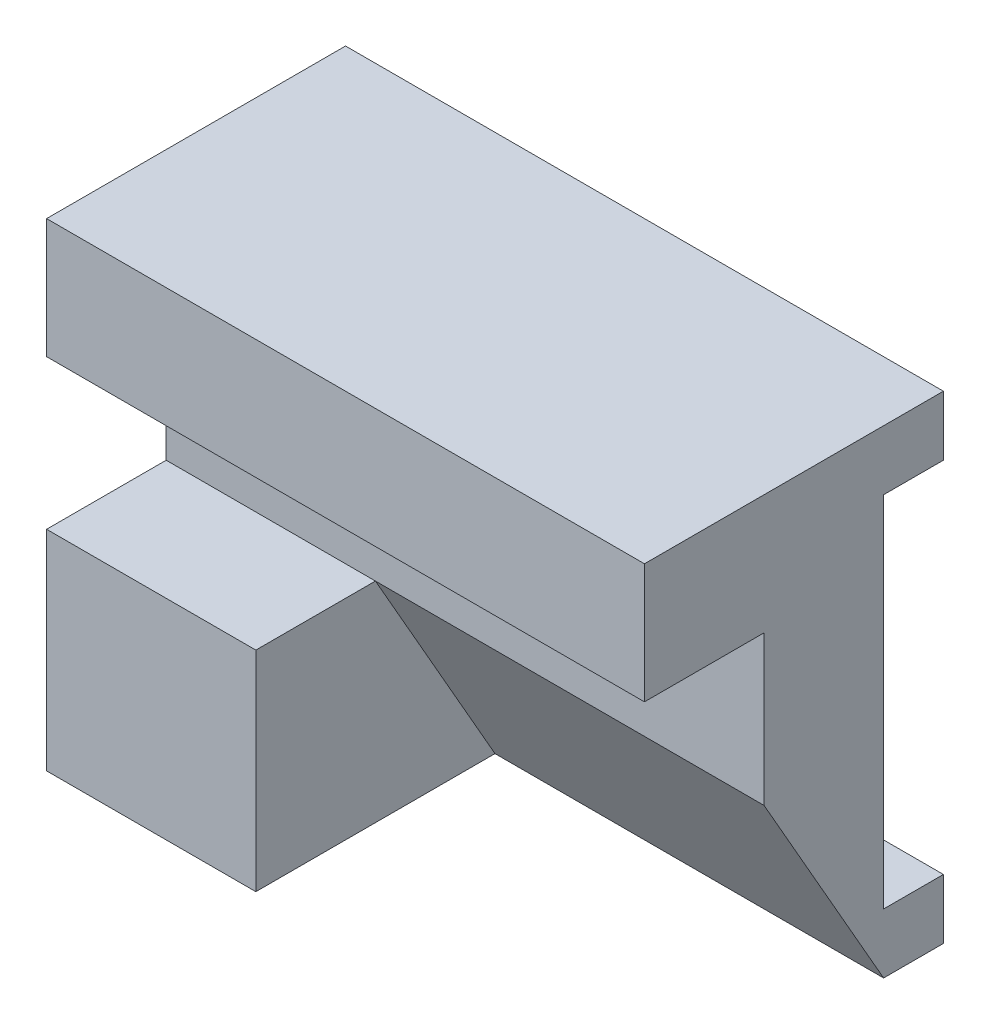
ISO-10303-21;
HEADER;
FILE_DESCRIPTION(('STEP AP214'),'2;1');
FILE_NAME('part.step','',(''),(''),'','','');
FILE_SCHEMA(('AUTOMOTIVE_DESIGN { 1 0 10303 214 1 1 1 1 }'));
ENDSEC;
DATA;
#1=APPLICATION_CONTEXT('core data for automotive mechanical design processes');
#2=APPLICATION_PROTOCOL_DEFINITION('international standard','automotive_design',2000,#1);
#3=PRODUCT_CONTEXT('',#1,'mechanical');
#4=PRODUCT('Part','Part','',(#3));
#5=PRODUCT_RELATED_PRODUCT_CATEGORY('part','',(#4));
#6=PRODUCT_DEFINITION_FORMATION('','',#4);
#7=PRODUCT_DEFINITION_CONTEXT('part definition',#1,'design');
#8=PRODUCT_DEFINITION('design','',#6,#7);
#9=PRODUCT_DEFINITION_SHAPE('','',#8);
#10=(LENGTH_UNIT() NAMED_UNIT(*) SI_UNIT(.MILLI.,.METRE.));
#11=(NAMED_UNIT(*) PLANE_ANGLE_UNIT() SI_UNIT($,.RADIAN.));
#12=(NAMED_UNIT(*) SI_UNIT($,.STERADIAN.) SOLID_ANGLE_UNIT());
#13=UNCERTAINTY_MEASURE_WITH_UNIT(LENGTH_MEASURE(1.E-05),#10,'distance_accuracy_value','');
#14=(GEOMETRIC_REPRESENTATION_CONTEXT(3) GLOBAL_UNCERTAINTY_ASSIGNED_CONTEXT((#13)) GLOBAL_UNIT_ASSIGNED_CONTEXT((#10,
#11,#12)) REPRESENTATION_CONTEXT('',''));
#15=CARTESIAN_POINT('',(0.,0.,0.));
#16=DIRECTION('',(0.,0.,1.));
#17=DIRECTION('',(1.,0.,0.));
#18=AXIS2_PLACEMENT_3D('',#15,#16,#17);
#19=CARTESIAN_POINT('',(0.,0.,0.));
#20=DIRECTION('',(0.,0.,1.));
#21=DIRECTION('',(1.,0.,0.));
#22=AXIS2_PLACEMENT_3D('',#19,#20,#21);
#23=PLANE('',#22);
#24=CARTESIAN_POINT('',(15.,-32.5,0.));
#25=DIRECTION('',(0.,0.,1.));
#26=DIRECTION('',(1.,0.,0.));
#27=AXIS2_PLACEMENT_3D('',#24,#25,#26);
#28=CIRCLE('',#27,6.);
#29=CARTESIAN_POINT('',(21.,-32.5,0.));
#30=VERTEX_POINT('',#29);
#31=EDGE_CURVE('E266',#30,#30,#28,.T.);
#32=ORIENTED_EDGE('',*,*,#31,.T.);
#33=EDGE_LOOP('',(#32));
#34=FACE_BOUND('',#33,.T.);
#35=CARTESIAN_POINT('',(75.,-32.5,0.));
#36=DIRECTION('',(0.,0.,1.));
#37=DIRECTION('',(1.,0.,0.));
#38=AXIS2_PLACEMENT_3D('',#35,#36,#37);
#39=CIRCLE('',#38,6.);
#40=CARTESIAN_POINT('',(81.,-32.5,0.));
#41=VERTEX_POINT('',#40);
#42=EDGE_CURVE('E241',#41,#41,#39,.T.);
#43=ORIENTED_EDGE('',*,*,#42,.T.);
#44=EDGE_LOOP('',(#43));
#45=FACE_BOUND('',#44,.T.);
#46=DIRECTION('',(-1.,0.,0.));
#47=VECTOR('',#46,1.);
#48=CARTESIAN_POINT('',(114.142135623731,-10.,0.));
#49=LINE('',#48,#47);
#50=CARTESIAN_POINT('',(100.,-10.,0.));
#51=VERTEX_POINT('',#50);
#52=CARTESIAN_POINT('',(0.,-10.,0.));
#53=VERTEX_POINT('',#52);
#54=EDGE_CURVE('E61',#51,#53,#49,.T.);
#55=ORIENTED_EDGE('',*,*,#54,.F.);
#56=DIRECTION('',(0.,-1.,0.));
#57=VECTOR('',#56,1.);
#58=CARTESIAN_POINT('',(100.,0.,0.));
#59=LINE('',#58,#57);
#60=CARTESIAN_POINT('',(100.,-70.,0.));
#61=VERTEX_POINT('',#60);
#62=EDGE_CURVE('E247',#51,#61,#59,.T.);
#63=ORIENTED_EDGE('',*,*,#62,.T.);
#64=DIRECTION('',(-1.,0.,0.));
#65=VECTOR('',#64,1.);
#66=CARTESIAN_POINT('',(114.142135623731,-70.,0.));
#67=LINE('',#66,#65);
#68=CARTESIAN_POINT('',(0.,-70.,0.));
#69=VERTEX_POINT('',#68);
#70=EDGE_CURVE('E171',#61,#69,#67,.T.);
#71=ORIENTED_EDGE('',*,*,#70,.T.);
#72=DIRECTION('',(0.,-1.,0.));
#73=VECTOR('',#72,1.);
#74=CARTESIAN_POINT('',(0.,0.,0.));
#75=LINE('',#74,#73);
#76=EDGE_CURVE('E57',#53,#69,#75,.T.);
#77=ORIENTED_EDGE('',*,*,#76,.F.);
#78=EDGE_LOOP('',(#55,#63,#71,#77));
#79=FACE_BOUND('',#78,.T.);
#80=ADVANCED_FACE('F41',(#34,#45,#79),#23,.F.);
#81=CARTESIAN_POINT('',(0.,0.,20.));
#82=DIRECTION('',(1.,0.,0.));
#83=DIRECTION('',(0.,0.,-1.));
#84=AXIS2_PLACEMENT_3D('',#81,#82,#83);
#85=PLANE('',#84);
#86=DIRECTION('',(0.,0.,-1.));
#87=VECTOR('',#86,1.);
#88=CARTESIAN_POINT('',(0.,0.,40.));
#89=LINE('',#88,#87);
#90=CARTESIAN_POINT('',(0.,0.,40.));
#91=VERTEX_POINT('',#90);
#92=CARTESIAN_POINT('',(0.,0.,-9.99999999999999));
#93=VERTEX_POINT('',#92);
#94=EDGE_CURVE('E208',#91,#93,#89,.T.);
#95=ORIENTED_EDGE('',*,*,#94,.T.);
#96=DIRECTION('',(0.,1.,0.));
#97=VECTOR('',#96,1.);
#98=CARTESIAN_POINT('',(0.,0.,-9.99999999999999));
#99=LINE('',#98,#97);
#100=CARTESIAN_POINT('',(0.,-10.,-10.));
#101=VERTEX_POINT('',#100);
#102=EDGE_CURVE('E291',#101,#93,#99,.T.);
#103=ORIENTED_EDGE('',*,*,#102,.F.);
#104=DIRECTION('',(0.,0.,-1.));
#105=VECTOR('',#104,1.);
#106=CARTESIAN_POINT('',(0.,-10.,0.));
#107=LINE('',#106,#105);
#108=EDGE_CURVE('E295',#53,#101,#107,.T.);
#109=ORIENTED_EDGE('',*,*,#108,.F.);
#110=ORIENTED_EDGE('',*,*,#76,.T.);
#111=DIRECTION('',(0.,0.,1.));
#112=VECTOR('',#111,1.);
#113=CARTESIAN_POINT('',(0.,-70.,0.));
#114=LINE('',#113,#112);
#115=CARTESIAN_POINT('',(0.,-70.,-10.));
#116=VERTEX_POINT('',#115);
#117=EDGE_CURVE('E184',#116,#69,#114,.T.);
#118=ORIENTED_EDGE('',*,*,#117,.F.);
#119=DIRECTION('',(0.,1.,0.));
#120=VECTOR('',#119,1.);
#121=CARTESIAN_POINT('',(0.,-80.,-10.));
#122=LINE('',#121,#120);
#123=CARTESIAN_POINT('',(0.,-80.,-10.));
#124=VERTEX_POINT('',#123);
#125=EDGE_CURVE('E170',#124,#116,#122,.T.);
#126=ORIENTED_EDGE('',*,*,#125,.F.);
#127=DIRECTION('',(0.,0.,-1.));
#128=VECTOR('',#127,1.);
#129=CARTESIAN_POINT('',(0.,-80.,40.));
#130=LINE('',#129,#128);
#131=CARTESIAN_POINT('',(0.,-80.,40.));
#132=VERTEX_POINT('',#131);
#133=EDGE_CURVE('E165',#132,#124,#130,.T.);
#134=ORIENTED_EDGE('',*,*,#133,.F.);
#135=DIRECTION('',(0.,-1.,0.));
#136=VECTOR('',#135,1.);
#137=CARTESIAN_POINT('',(0.,0.,40.));
#138=LINE('',#137,#136);
#139=CARTESIAN_POINT('',(0.,-45.,40.));
#140=VERTEX_POINT('',#139);
#141=EDGE_CURVE('E222',#140,#132,#138,.T.);
#142=ORIENTED_EDGE('',*,*,#141,.F.);
#143=DIRECTION('',(0.,0.,-1.));
#144=VECTOR('',#143,1.);
#145=CARTESIAN_POINT('',(0.,-45.,40.));
#146=LINE('',#145,#144);
#147=CARTESIAN_POINT('',(0.,-45.,20.));
#148=VERTEX_POINT('',#147);
#149=EDGE_CURVE('E233',#140,#148,#146,.T.);
#150=ORIENTED_EDGE('',*,*,#149,.T.);
#151=DIRECTION('',(0.,-1.,0.));
#152=VECTOR('',#151,1.);
#153=CARTESIAN_POINT('',(0.,0.,20.));
#154=LINE('',#153,#152);
#155=CARTESIAN_POINT('',(0.,-20.,20.));
#156=VERTEX_POINT('',#155);
#157=EDGE_CURVE('E251',#156,#148,#154,.T.);
#158=ORIENTED_EDGE('',*,*,#157,.F.);
#159=DIRECTION('',(0.,0.,-1.));
#160=VECTOR('',#159,1.);
#161=CARTESIAN_POINT('',(0.,-20.,40.));
#162=LINE('',#161,#160);
#163=CARTESIAN_POINT('',(0.,-20.,40.));
#164=VERTEX_POINT('',#163);
#165=EDGE_CURVE('E204',#164,#156,#162,.T.);
#166=ORIENTED_EDGE('',*,*,#165,.F.);
#167=DIRECTION('',(0.,-1.,0.));
#168=VECTOR('',#167,1.);
#169=CARTESIAN_POINT('',(0.,0.,40.));
#170=LINE('',#169,#168);
#171=EDGE_CURVE('E195',#91,#164,#170,.T.);
#172=ORIENTED_EDGE('',*,*,#171,.F.);
#173=EDGE_LOOP('',(#95,#103,#109,#110,#118,#126,#134,#142,#150,#158,#166,#172));
#174=FACE_BOUND('',#173,.T.);
#175=ADVANCED_FACE('F325',(#174),#85,.F.);
#176=CARTESIAN_POINT('',(0.,-80.,20.));
#177=DIRECTION('',(0.,1.,0.));
#178=DIRECTION('',(0.,0.,1.));
#179=AXIS2_PLACEMENT_3D('',#176,#177,#178);
#180=PLANE('',#179);
#181=DIRECTION('',(0.,0.,-1.));
#182=VECTOR('',#181,1.);
#183=CARTESIAN_POINT('',(100.,-80.,20.));
#184=LINE('',#183,#182);
#185=CARTESIAN_POINT('',(100.,-80.,0.));
#186=VERTEX_POINT('',#185);
#187=CARTESIAN_POINT('',(100.,-80.,-10.));
#188=VERTEX_POINT('',#187);
#189=EDGE_CURVE('E11',#186,#188,#184,.T.);
#190=ORIENTED_EDGE('',*,*,#189,.F.);
#191=DIRECTION('',(1.,0.,0.));
#192=VECTOR('',#191,1.);
#193=CARTESIAN_POINT('',(-5.31128874149274,-80.,0.));
#194=LINE('',#193,#192);
#195=CARTESIAN_POINT('',(35.,-80.,0.));
#196=VERTEX_POINT('',#195);
#197=EDGE_CURVE('E137',#196,#186,#194,.T.);
#198=ORIENTED_EDGE('',*,*,#197,.F.);
#199=DIRECTION('',(0.,0.,-1.));
#200=VECTOR('',#199,1.);
#201=CARTESIAN_POINT('',(35.,-80.,40.));
#202=LINE('',#201,#200);
#203=CARTESIAN_POINT('',(35.,-80.,40.));
#204=VERTEX_POINT('',#203);
#205=EDGE_CURVE('E228',#204,#196,#202,.T.);
#206=ORIENTED_EDGE('',*,*,#205,.F.);
#207=DIRECTION('',(1.,0.,0.));
#208=VECTOR('',#207,1.);
#209=CARTESIAN_POINT('',(0.,-80.,40.));
#210=LINE('',#209,#208);
#211=EDGE_CURVE('E225',#132,#204,#210,.T.);
#212=ORIENTED_EDGE('',*,*,#211,.F.);
#213=ORIENTED_EDGE('',*,*,#133,.T.);
#214=DIRECTION('',(-1.,0.,0.));
#215=VECTOR('',#214,1.);
#216=CARTESIAN_POINT('',(114.142135623731,-80.,-10.));
#217=LINE('',#216,#215);
#218=EDGE_CURVE('E162',#188,#124,#217,.T.);
#219=ORIENTED_EDGE('',*,*,#218,.F.);
#220=EDGE_LOOP('',(#190,#198,#206,#212,#213,#219));
#221=FACE_BOUND('',#220,.T.);
#222=ADVANCED_FACE('F160',(#221),#180,.F.);
#223=CARTESIAN_POINT('',(100.,0.,20.));
#224=DIRECTION('',(1.,0.,0.));
#225=DIRECTION('',(0.,0.,-1.));
#226=AXIS2_PLACEMENT_3D('',#223,#224,#225);
#227=PLANE('',#226);
#228=DIRECTION('',(0.,0.868243142124459,0.496138938356834));
#229=VECTOR('',#228,1.);
#230=CARTESIAN_POINT('',(100.,-45.,20.));
#231=LINE('',#230,#229);
#232=CARTESIAN_POINT('',(100.,-45.,20.));
#233=VERTEX_POINT('',#232);
#234=EDGE_CURVE('E140',#186,#233,#231,.T.);
#235=ORIENTED_EDGE('',*,*,#234,.F.);
#236=ORIENTED_EDGE('',*,*,#189,.T.);
#237=DIRECTION('',(0.,1.,0.));
#238=VECTOR('',#237,1.);
#239=CARTESIAN_POINT('',(100.,-80.,-10.));
#240=LINE('',#239,#238);
#241=CARTESIAN_POINT('',(100.,-70.,-10.));
#242=VERTEX_POINT('',#241);
#243=EDGE_CURVE('E191',#188,#242,#240,.T.);
#244=ORIENTED_EDGE('',*,*,#243,.T.);
#245=DIRECTION('',(0.,0.,1.));
#246=VECTOR('',#245,1.);
#247=CARTESIAN_POINT('',(100.,-70.,0.));
#248=LINE('',#247,#246);
#249=EDGE_CURVE('E181',#242,#61,#248,.T.);
#250=ORIENTED_EDGE('',*,*,#249,.T.);
#251=ORIENTED_EDGE('',*,*,#62,.F.);
#252=DIRECTION('',(0.,0.,-1.));
#253=VECTOR('',#252,1.);
#254=CARTESIAN_POINT('',(100.,-10.,0.));
#255=LINE('',#254,#253);
#256=CARTESIAN_POINT('',(100.,-10.,-10.));
#257=VERTEX_POINT('',#256);
#258=EDGE_CURVE('E290',#51,#257,#255,.T.);
#259=ORIENTED_EDGE('',*,*,#258,.T.);
#260=DIRECTION('',(0.,1.,0.));
#261=VECTOR('',#260,1.);
#262=CARTESIAN_POINT('',(100.,0.,-9.99999999999999));
#263=LINE('',#262,#261);
#264=CARTESIAN_POINT('',(100.,0.,-9.99999999999999));
#265=VERTEX_POINT('',#264);
#266=EDGE_CURVE('E177',#257,#265,#263,.T.);
#267=ORIENTED_EDGE('',*,*,#266,.T.);
#268=DIRECTION('',(0.,0.,-1.));
#269=VECTOR('',#268,1.);
#270=CARTESIAN_POINT('',(100.,0.,40.));
#271=LINE('',#270,#269);
#272=CARTESIAN_POINT('',(100.,0.,40.));
#273=VERTEX_POINT('',#272);
#274=EDGE_CURVE('E211',#273,#265,#271,.T.);
#275=ORIENTED_EDGE('',*,*,#274,.F.);
#276=DIRECTION('',(0.,-1.,0.));
#277=VECTOR('',#276,1.);
#278=CARTESIAN_POINT('',(100.,0.,40.));
#279=LINE('',#278,#277);
#280=CARTESIAN_POINT('',(100.,-20.,40.));
#281=VERTEX_POINT('',#280);
#282=EDGE_CURVE('E186',#273,#281,#279,.T.);
#283=ORIENTED_EDGE('',*,*,#282,.T.);
#284=DIRECTION('',(0.,0.,-1.));
#285=VECTOR('',#284,1.);
#286=CARTESIAN_POINT('',(100.,-20.,40.));
#287=LINE('',#286,#285);
#288=CARTESIAN_POINT('',(100.,-20.,20.));
#289=VERTEX_POINT('',#288);
#290=EDGE_CURVE('E201',#281,#289,#287,.T.);
#291=ORIENTED_EDGE('',*,*,#290,.T.);
#292=DIRECTION('',(0.,-1.,0.));
#293=VECTOR('',#292,1.);
#294=CARTESIAN_POINT('',(100.,0.,20.));
#295=LINE('',#294,#293);
#296=EDGE_CURVE('E156',#289,#233,#295,.T.);
#297=ORIENTED_EDGE('',*,*,#296,.T.);
#298=EDGE_LOOP('',(#235,#236,#244,#250,#251,#259,#267,#275,#283,#291,#297));
#299=FACE_BOUND('',#298,.T.);
#300=ADVANCED_FACE('F152',(#299),#227,.T.);
#301=CARTESIAN_POINT('',(15.,-32.5,20.));
#302=DIRECTION('',(0.,0.,-1.));
#303=DIRECTION('',(-1.,0.,0.));
#304=AXIS2_PLACEMENT_3D('',#301,#302,#303);
#305=CYLINDRICAL_SURFACE('',#304,6.);
#306=CARTESIAN_POINT('',(15.,-32.5,20.));
#307=DIRECTION('',(0.,0.,1.));
#308=DIRECTION('',(1.,0.,0.));
#309=AXIS2_PLACEMENT_3D('',#306,#307,#308);
#310=CIRCLE('',#309,6.);
#311=CARTESIAN_POINT('',(21.,-32.5,20.));
#312=VERTEX_POINT('',#311);
#313=EDGE_CURVE('E246',#312,#312,#310,.T.);
#314=ORIENTED_EDGE('',*,*,#313,.T.);
#315=EDGE_LOOP('',(#314));
#316=FACE_BOUND('',#315,.T.);
#317=ORIENTED_EDGE('',*,*,#31,.F.);
#318=EDGE_LOOP('',(#317));
#319=FACE_BOUND('',#318,.T.);
#320=ADVANCED_FACE('F352',(#316,#319),#305,.F.);
#321=CARTESIAN_POINT('',(75.,-32.5,20.));
#322=DIRECTION('',(0.,0.,-1.));
#323=DIRECTION('',(-1.,0.,0.));
#324=AXIS2_PLACEMENT_3D('',#321,#322,#323);
#325=CYLINDRICAL_SURFACE('',#324,6.);
#326=CARTESIAN_POINT('',(75.,-32.5,20.));
#327=DIRECTION('',(0.,0.,1.));
#328=DIRECTION('',(1.,0.,0.));
#329=AXIS2_PLACEMENT_3D('',#326,#327,#328);
#330=CIRCLE('',#329,6.);
#331=CARTESIAN_POINT('',(81.,-32.5,20.));
#332=VERTEX_POINT('',#331);
#333=EDGE_CURVE('E242',#332,#332,#330,.T.);
#334=ORIENTED_EDGE('',*,*,#333,.T.);
#335=EDGE_LOOP('',(#334));
#336=FACE_BOUND('',#335,.T.);
#337=ORIENTED_EDGE('',*,*,#42,.F.);
#338=EDGE_LOOP('',(#337));
#339=FACE_BOUND('',#338,.T.);
#340=ADVANCED_FACE('F43',(#336,#339),#325,.F.);
#341=CARTESIAN_POINT('',(0.,0.,20.));
#342=DIRECTION('',(0.,0.,1.));
#343=DIRECTION('',(1.,0.,0.));
#344=AXIS2_PLACEMENT_3D('',#341,#342,#343);
#345=PLANE('',#344);
#346=DIRECTION('',(1.,0.,0.));
#347=VECTOR('',#346,1.);
#348=CARTESIAN_POINT('',(-5.31128874149274,-45.,20.));
#349=LINE('',#348,#347);
#350=CARTESIAN_POINT('',(35.,-45.,20.));
#351=VERTEX_POINT('',#350);
#352=EDGE_CURVE('E148',#351,#233,#349,.T.);
#353=ORIENTED_EDGE('',*,*,#352,.T.);
#354=ORIENTED_EDGE('',*,*,#296,.F.);
#355=DIRECTION('',(1.,0.,0.));
#356=VECTOR('',#355,1.);
#357=CARTESIAN_POINT('',(0.,-20.,20.));
#358=LINE('',#357,#356);
#359=EDGE_CURVE('E50',#156,#289,#358,.T.);
#360=ORIENTED_EDGE('',*,*,#359,.F.);
#361=ORIENTED_EDGE('',*,*,#157,.T.);
#362=DIRECTION('',(1.,0.,0.));
#363=VECTOR('',#362,1.);
#364=CARTESIAN_POINT('',(0.,-45.,20.));
#365=LINE('',#364,#363);
#366=EDGE_CURVE('E254',#148,#351,#365,.T.);
#367=ORIENTED_EDGE('',*,*,#366,.T.);
#368=EDGE_LOOP('',(#353,#354,#360,#361,#367));
#369=FACE_BOUND('',#368,.T.);
#370=ORIENTED_EDGE('',*,*,#333,.F.);
#371=EDGE_LOOP('',(#370));
#372=FACE_BOUND('',#371,.T.);
#373=ORIENTED_EDGE('',*,*,#313,.F.);
#374=EDGE_LOOP('',(#373));
#375=FACE_BOUND('',#374,.T.);
#376=ADVANCED_FACE('F313',(#369,#372,#375),#345,.T.);
#377=CARTESIAN_POINT('',(35.,0.,40.));
#378=DIRECTION('',(1.,0.,0.));
#379=DIRECTION('',(0.,1.,0.));
#380=AXIS2_PLACEMENT_3D('',#377,#378,#379);
#381=PLANE('',#380);
#382=ORIENTED_EDGE('',*,*,#205,.T.);
#383=DIRECTION('',(0.,-0.868243142124459,-0.496138938356834));
#384=VECTOR('',#383,1.);
#385=CARTESIAN_POINT('',(35.,-45.,20.));
#386=LINE('',#385,#384);
#387=EDGE_CURVE('E143',#351,#196,#386,.T.);
#388=ORIENTED_EDGE('',*,*,#387,.F.);
#389=DIRECTION('',(0.,0.,-1.));
#390=VECTOR('',#389,1.);
#391=CARTESIAN_POINT('',(35.,-45.,40.));
#392=LINE('',#391,#390);
#393=CARTESIAN_POINT('',(35.,-45.,40.));
#394=VERTEX_POINT('',#393);
#395=EDGE_CURVE('E237',#394,#351,#392,.T.);
#396=ORIENTED_EDGE('',*,*,#395,.F.);
#397=DIRECTION('',(0.,-1.,0.));
#398=VECTOR('',#397,1.);
#399=CARTESIAN_POINT('',(35.,0.,40.));
#400=LINE('',#399,#398);
#401=EDGE_CURVE('E214',#394,#204,#400,.T.);
#402=ORIENTED_EDGE('',*,*,#401,.T.);
#403=EDGE_LOOP('',(#382,#388,#396,#402));
#404=FACE_BOUND('',#403,.T.);
#405=ADVANCED_FACE('F318',(#404),#381,.T.);
#406=CARTESIAN_POINT('',(0.,-45.,40.));
#407=DIRECTION('',(0.,1.,0.));
#408=DIRECTION('',(0.,0.,1.));
#409=AXIS2_PLACEMENT_3D('',#406,#407,#408);
#410=PLANE('',#409);
#411=ORIENTED_EDGE('',*,*,#395,.T.);
#412=ORIENTED_EDGE('',*,*,#366,.F.);
#413=ORIENTED_EDGE('',*,*,#149,.F.);
#414=DIRECTION('',(1.,0.,0.));
#415=VECTOR('',#414,1.);
#416=CARTESIAN_POINT('',(0.,-45.,40.));
#417=LINE('',#416,#415);
#418=EDGE_CURVE('E218',#140,#394,#417,.T.);
#419=ORIENTED_EDGE('',*,*,#418,.T.);
#420=EDGE_LOOP('',(#411,#412,#413,#419));
#421=FACE_BOUND('',#420,.T.);
#422=ADVANCED_FACE('F368',(#421),#410,.T.);
#423=CARTESIAN_POINT('',(0.,0.,40.));
#424=DIRECTION('',(0.,0.,1.));
#425=DIRECTION('',(1.,0.,0.));
#426=AXIS2_PLACEMENT_3D('',#423,#424,#425);
#427=PLANE('',#426);
#428=ORIENTED_EDGE('',*,*,#401,.F.);
#429=ORIENTED_EDGE('',*,*,#418,.F.);
#430=ORIENTED_EDGE('',*,*,#141,.T.);
#431=ORIENTED_EDGE('',*,*,#211,.T.);
#432=EDGE_LOOP('',(#428,#429,#430,#431));
#433=FACE_BOUND('',#432,.T.);
#434=ADVANCED_FACE('F321',(#433),#427,.T.);
#435=CARTESIAN_POINT('',(0.,-20.,40.));
#436=DIRECTION('',(0.,1.,0.));
#437=DIRECTION('',(0.,0.,1.));
#438=AXIS2_PLACEMENT_3D('',#435,#436,#437);
#439=PLANE('',#438);
#440=ORIENTED_EDGE('',*,*,#165,.T.);
#441=ORIENTED_EDGE('',*,*,#359,.T.);
#442=ORIENTED_EDGE('',*,*,#290,.F.);
#443=DIRECTION('',(1.,0.,0.));
#444=VECTOR('',#443,1.);
#445=CARTESIAN_POINT('',(0.,-20.,40.));
#446=LINE('',#445,#444);
#447=EDGE_CURVE('E198',#164,#281,#446,.T.);
#448=ORIENTED_EDGE('',*,*,#447,.F.);
#449=EDGE_LOOP('',(#440,#441,#442,#448));
#450=FACE_BOUND('',#449,.T.);
#451=ADVANCED_FACE('F377',(#450),#439,.F.);
#452=CARTESIAN_POINT('',(0.,0.,40.));
#453=DIRECTION('',(0.,1.,0.));
#454=DIRECTION('',(0.,0.,1.));
#455=AXIS2_PLACEMENT_3D('',#452,#453,#454);
#456=PLANE('',#455);
#457=ORIENTED_EDGE('',*,*,#274,.T.);
#458=DIRECTION('',(-1.,0.,0.));
#459=VECTOR('',#458,1.);
#460=CARTESIAN_POINT('',(114.142135623731,0.,-9.99999999999999));
#461=LINE('',#460,#459);
#462=EDGE_CURVE('E286',#265,#93,#461,.T.);
#463=ORIENTED_EDGE('',*,*,#462,.T.);
#464=ORIENTED_EDGE('',*,*,#94,.F.);
#465=DIRECTION('',(1.,0.,0.));
#466=VECTOR('',#465,1.);
#467=CARTESIAN_POINT('',(0.,0.,40.));
#468=LINE('',#467,#466);
#469=EDGE_CURVE('E190',#91,#273,#468,.T.);
#470=ORIENTED_EDGE('',*,*,#469,.T.);
#471=EDGE_LOOP('',(#457,#463,#464,#470));
#472=FACE_BOUND('',#471,.T.);
#473=ADVANCED_FACE('F336',(#472),#456,.T.);
#474=CARTESIAN_POINT('',(0.,0.,40.));
#475=DIRECTION('',(0.,0.,1.));
#476=DIRECTION('',(1.,0.,0.));
#477=AXIS2_PLACEMENT_3D('',#474,#475,#476);
#478=PLANE('',#477);
#479=ORIENTED_EDGE('',*,*,#282,.F.);
#480=ORIENTED_EDGE('',*,*,#469,.F.);
#481=ORIENTED_EDGE('',*,*,#171,.T.);
#482=ORIENTED_EDGE('',*,*,#447,.T.);
#483=EDGE_LOOP('',(#479,#480,#481,#482));
#484=FACE_BOUND('',#483,.T.);
#485=ADVANCED_FACE('F328',(#484),#478,.T.);
#486=CARTESIAN_POINT('',(114.142135623731,-80.,-10.));
#487=DIRECTION('',(0.,0.,1.));
#488=DIRECTION('',(1.,0.,0.));
#489=AXIS2_PLACEMENT_3D('',#486,#487,#488);
#490=PLANE('',#489);
#491=ORIENTED_EDGE('',*,*,#243,.F.);
#492=ORIENTED_EDGE('',*,*,#218,.T.);
#493=ORIENTED_EDGE('',*,*,#125,.T.);
#494=DIRECTION('',(-1.,0.,0.));
#495=VECTOR('',#494,1.);
#496=CARTESIAN_POINT('',(114.142135623731,-70.,-10.));
#497=LINE('',#496,#495);
#498=EDGE_CURVE('E175',#242,#116,#497,.T.);
#499=ORIENTED_EDGE('',*,*,#498,.F.);
#500=EDGE_LOOP('',(#491,#492,#493,#499));
#501=FACE_BOUND('',#500,.T.);
#502=ADVANCED_FACE('F326',(#501),#490,.F.);
#503=CARTESIAN_POINT('',(114.142135623731,-70.,0.));
#504=DIRECTION('',(0.,-1.,0.));
#505=DIRECTION('',(0.,0.,-1.));
#506=AXIS2_PLACEMENT_3D('',#503,#504,#505);
#507=PLANE('',#506);
#508=ORIENTED_EDGE('',*,*,#249,.F.);
#509=ORIENTED_EDGE('',*,*,#498,.T.);
#510=ORIENTED_EDGE('',*,*,#117,.T.);
#511=ORIENTED_EDGE('',*,*,#70,.F.);
#512=EDGE_LOOP('',(#508,#509,#510,#511));
#513=FACE_BOUND('',#512,.T.);
#514=ADVANCED_FACE('F279',(#513),#507,.F.);
#515=CARTESIAN_POINT('',(114.142135623731,-10.,0.));
#516=DIRECTION('',(0.,1.,0.));
#517=DIRECTION('',(0.,0.,1.));
#518=AXIS2_PLACEMENT_3D('',#515,#516,#517);
#519=PLANE('',#518);
#520=ORIENTED_EDGE('',*,*,#258,.F.);
#521=ORIENTED_EDGE('',*,*,#54,.T.);
#522=ORIENTED_EDGE('',*,*,#108,.T.);
#523=DIRECTION('',(-1.,0.,0.));
#524=VECTOR('',#523,1.);
#525=CARTESIAN_POINT('',(114.142135623731,-10.,-10.));
#526=LINE('',#525,#524);
#527=EDGE_CURVE('E292',#257,#101,#526,.T.);
#528=ORIENTED_EDGE('',*,*,#527,.F.);
#529=EDGE_LOOP('',(#520,#521,#522,#528));
#530=FACE_BOUND('',#529,.T.);
#531=ADVANCED_FACE('F334',(#530),#519,.F.);
#532=CARTESIAN_POINT('',(114.142135623731,0.,-9.99999999999999));
#533=DIRECTION('',(0.,0.,1.));
#534=DIRECTION('',(0.,-1.,0.));
#535=AXIS2_PLACEMENT_3D('',#532,#533,#534);
#536=PLANE('',#535);
#537=ORIENTED_EDGE('',*,*,#266,.F.);
#538=ORIENTED_EDGE('',*,*,#527,.T.);
#539=ORIENTED_EDGE('',*,*,#102,.T.);
#540=ORIENTED_EDGE('',*,*,#462,.F.);
#541=EDGE_LOOP('',(#537,#538,#539,#540));
#542=FACE_BOUND('',#541,.T.);
#543=ADVANCED_FACE('F394',(#542),#536,.F.);
#544=CARTESIAN_POINT('',(-5.31128874149274,-45.,20.));
#545=DIRECTION('',(0.,0.496138938356834,-0.868243142124459));
#546=DIRECTION('',(0.,0.868243142124459,0.496138938356834));
#547=AXIS2_PLACEMENT_3D('',#544,#545,#546);
#548=PLANE('',#547);
#549=ORIENTED_EDGE('',*,*,#387,.T.);
#550=ORIENTED_EDGE('',*,*,#197,.T.);
#551=ORIENTED_EDGE('',*,*,#234,.T.);
#552=ORIENTED_EDGE('',*,*,#352,.F.);
#553=EDGE_LOOP('',(#549,#550,#551,#552));
#554=FACE_BOUND('',#553,.T.);
#555=ADVANCED_FACE('F139',(#554),#548,.F.);
#556=CLOSED_SHELL('',(#80,#175,#222,#300,#320,#340,#376,#405,#422,#434,#451,#473,#485,#502,#514,
#531,#543,#555));
#557=MANIFOLD_SOLID_BREP('B2',#556);
#558=ADVANCED_BREP_SHAPE_REPRESENTATION('',(#18,#557),#14);
#559=SHAPE_DEFINITION_REPRESENTATION(#9,#558);
ENDSEC;
END-ISO-10303-21;
